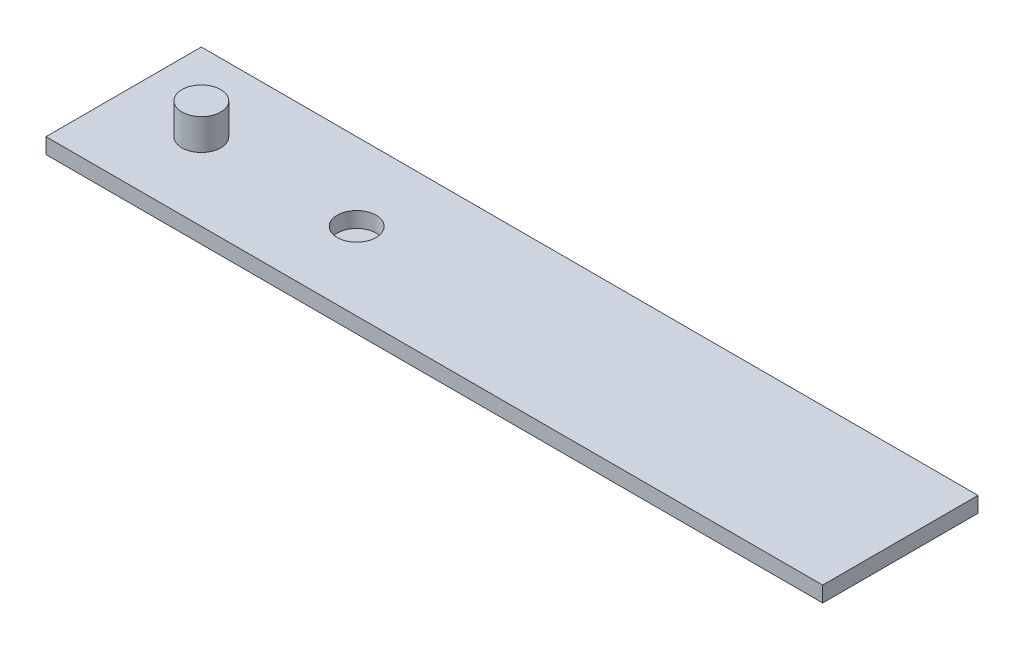
ISO-10303-21;
HEADER;
FILE_DESCRIPTION(('STEP AP214'),'2;1');
FILE_NAME('part.step','',(''),(''),'','','');
FILE_SCHEMA(('AUTOMOTIVE_DESIGN { 1 0 10303 214 1 1 1 1 }'));
ENDSEC;
DATA;
#1=APPLICATION_CONTEXT('core data for automotive mechanical design processes');
#2=APPLICATION_PROTOCOL_DEFINITION('international standard','automotive_design',2000,#1);
#3=PRODUCT_CONTEXT('',#1,'mechanical');
#4=PRODUCT('Part','Part','',(#3));
#5=PRODUCT_RELATED_PRODUCT_CATEGORY('part','',(#4));
#6=PRODUCT_DEFINITION_FORMATION('','',#4);
#7=PRODUCT_DEFINITION_CONTEXT('part definition',#1,'design');
#8=PRODUCT_DEFINITION('design','',#6,#7);
#9=PRODUCT_DEFINITION_SHAPE('','',#8);
#10=(LENGTH_UNIT() NAMED_UNIT(*) SI_UNIT(.MILLI.,.METRE.));
#11=(NAMED_UNIT(*) PLANE_ANGLE_UNIT() SI_UNIT($,.RADIAN.));
#12=(NAMED_UNIT(*) SI_UNIT($,.STERADIAN.) SOLID_ANGLE_UNIT());
#13=UNCERTAINTY_MEASURE_WITH_UNIT(LENGTH_MEASURE(1.E-05),#10,'distance_accuracy_value','');
#14=(GEOMETRIC_REPRESENTATION_CONTEXT(3) GLOBAL_UNCERTAINTY_ASSIGNED_CONTEXT((#13)) GLOBAL_UNIT_ASSIGNED_CONTEXT((#10,
#11,#12)) REPRESENTATION_CONTEXT('',''));
#15=CARTESIAN_POINT('',(0.,0.,0.));
#16=DIRECTION('',(0.,0.,1.));
#17=DIRECTION('',(1.,0.,0.));
#18=AXIS2_PLACEMENT_3D('',#15,#16,#17);
#19=CARTESIAN_POINT('',(38.1,-2.54,-12.7));
#20=DIRECTION('',(0.,1.,0.));
#21=DIRECTION('',(0.,0.,1.));
#22=AXIS2_PLACEMENT_3D('',#19,#20,#21);
#23=CYLINDRICAL_SURFACE('',#22,3.175);
#24=CARTESIAN_POINT('',(38.1,-2.54,-12.7));
#25=DIRECTION('',(0.,1.,0.));
#26=DIRECTION('',(0.,0.,1.));
#27=AXIS2_PLACEMENT_3D('',#24,#25,#26);
#28=CIRCLE('',#27,3.175);
#29=CARTESIAN_POINT('',(38.1,-2.54,-9.525));
#30=VERTEX_POINT('',#29);
#31=EDGE_CURVE('E11',#30,#30,#28,.T.);
#32=ORIENTED_EDGE('',*,*,#31,.T.);
#33=EDGE_LOOP('',(#32));
#34=FACE_BOUND('',#33,.T.);
#35=CARTESIAN_POINT('',(38.1,0.,-12.7));
#36=DIRECTION('',(0.,1.,0.));
#37=DIRECTION('',(0.,0.,1.));
#38=AXIS2_PLACEMENT_3D('',#35,#36,#37);
#39=CIRCLE('',#38,3.175);
#40=CARTESIAN_POINT('',(38.1,0.,-9.525));
#41=VERTEX_POINT('',#40);
#42=EDGE_CURVE('E50',#41,#41,#39,.T.);
#43=ORIENTED_EDGE('',*,*,#42,.F.);
#44=EDGE_LOOP('',(#43));
#45=FACE_BOUND('',#44,.T.);
#46=ADVANCED_FACE('F47',(#34,#45),#23,.T.);
#47=CARTESIAN_POINT('',(0.,-2.54,0.));
#48=DIRECTION('',(0.,1.,0.));
#49=DIRECTION('',(0.,0.,1.));
#50=AXIS2_PLACEMENT_3D('',#47,#48,#49);
#51=PLANE('',#50);
#52=ORIENTED_EDGE('',*,*,#31,.F.);
#53=EDGE_LOOP('',(#52));
#54=FACE_BOUND('',#53,.T.);
#55=ADVANCED_FACE('F62',(#54),#51,.F.);
#56=CARTESIAN_POINT('',(0.,0.,0.));
#57=DIRECTION('',(0.,1.,0.));
#58=DIRECTION('',(0.,0.,1.));
#59=AXIS2_PLACEMENT_3D('',#56,#57,#58);
#60=PLANE('',#59);
#61=ORIENTED_EDGE('',*,*,#42,.T.);
#62=EDGE_LOOP('',(#61));
#63=FACE_BOUND('',#62,.T.);
#64=ADVANCED_FACE('F59',(#63),#60,.T.);
#65=CLOSED_SHELL('',(#46,#55,#64));
#66=MANIFOLD_SOLID_BREP('B2',#65);
#67=CARTESIAN_POINT('',(0.,2.54,0.));
#68=DIRECTION('',(0.,-1.,0.));
#69=DIRECTION('',(0.,0.,-1.));
#70=AXIS2_PLACEMENT_3D('',#67,#68,#69);
#71=PLANE('',#70);
#72=DIRECTION('',(0.,0.,1.));
#73=VECTOR('',#72,1.);
#74=CARTESIAN_POINT('',(0.,2.54,0.));
#75=LINE('',#74,#73);
#76=CARTESIAN_POINT('',(0.,2.54,-25.4));
#77=VERTEX_POINT('',#76);
#78=CARTESIAN_POINT('',(0.,2.54,0.));
#79=VERTEX_POINT('',#78);
#80=EDGE_CURVE('E147',#77,#79,#75,.T.);
#81=ORIENTED_EDGE('',*,*,#80,.T.);
#82=DIRECTION('',(1.,0.,0.));
#83=VECTOR('',#82,1.);
#84=CARTESIAN_POINT('',(0.,2.54,0.));
#85=LINE('',#84,#83);
#86=CARTESIAN_POINT('',(127.,2.54,0.));
#87=VERTEX_POINT('',#86);
#88=EDGE_CURVE('E142',#79,#87,#85,.T.);
#89=ORIENTED_EDGE('',*,*,#88,.T.);
#90=DIRECTION('',(0.,0.,-1.));
#91=VECTOR('',#90,1.);
#92=CARTESIAN_POINT('',(127.,2.54,0.));
#93=LINE('',#92,#91);
#94=CARTESIAN_POINT('',(127.,2.54,-25.4));
#95=VERTEX_POINT('',#94);
#96=EDGE_CURVE('E145',#87,#95,#93,.T.);
#97=ORIENTED_EDGE('',*,*,#96,.T.);
#98=DIRECTION('',(-1.,0.,0.));
#99=VECTOR('',#98,1.);
#100=CARTESIAN_POINT('',(0.,2.54,-25.4));
#101=LINE('',#100,#99);
#102=EDGE_CURVE('E112',#95,#77,#101,.T.);
#103=ORIENTED_EDGE('',*,*,#102,.T.);
#104=EDGE_LOOP('',(#81,#89,#97,#103));
#105=FACE_BOUND('',#104,.T.);
#106=CARTESIAN_POINT('',(12.7,2.54,-12.7));
#107=DIRECTION('',(0.,1.,0.));
#108=DIRECTION('',(0.,0.,1.));
#109=AXIS2_PLACEMENT_3D('',#106,#107,#108);
#110=CIRCLE('',#109,3.175);
#111=CARTESIAN_POINT('',(12.7,2.54,-9.525));
#112=VERTEX_POINT('',#111);
#113=EDGE_CURVE('E167',#112,#112,#110,.T.);
#114=ORIENTED_EDGE('',*,*,#113,.F.);
#115=EDGE_LOOP('',(#114));
#116=FACE_BOUND('',#115,.T.);
#117=CARTESIAN_POINT('',(38.1,2.54,-12.7));
#118=DIRECTION('',(0.,1.,0.));
#119=DIRECTION('',(0.,0.,1.));
#120=AXIS2_PLACEMENT_3D('',#117,#118,#119);
#121=CIRCLE('',#120,3.175);
#122=CARTESIAN_POINT('',(38.1,2.54,-9.525));
#123=VERTEX_POINT('',#122);
#124=EDGE_CURVE('E188',#123,#123,#121,.T.);
#125=ORIENTED_EDGE('',*,*,#124,.F.);
#126=EDGE_LOOP('',(#125));
#127=FACE_BOUND('',#126,.T.);
#128=ADVANCED_FACE('F94',(#105,#116,#127),#71,.F.);
#129=CARTESIAN_POINT('',(0.,0.,0.));
#130=DIRECTION('',(0.,-1.,0.));
#131=DIRECTION('',(0.,0.,-1.));
#132=AXIS2_PLACEMENT_3D('',#129,#130,#131);
#133=PLANE('',#132);
#134=DIRECTION('',(0.,0.,1.));
#135=VECTOR('',#134,1.);
#136=CARTESIAN_POINT('',(0.,0.,0.));
#137=LINE('',#136,#135);
#138=CARTESIAN_POINT('',(0.,0.,-25.4));
#139=VERTEX_POINT('',#138);
#140=CARTESIAN_POINT('',(0.,0.,0.));
#141=VERTEX_POINT('',#140);
#142=EDGE_CURVE('E163',#139,#141,#137,.T.);
#143=ORIENTED_EDGE('',*,*,#142,.F.);
#144=DIRECTION('',(-1.,0.,0.));
#145=VECTOR('',#144,1.);
#146=CARTESIAN_POINT('',(0.,0.,-25.4));
#147=LINE('',#146,#145);
#148=CARTESIAN_POINT('',(127.,0.,-25.4));
#149=VERTEX_POINT('',#148);
#150=EDGE_CURVE('E135',#149,#139,#147,.T.);
#151=ORIENTED_EDGE('',*,*,#150,.F.);
#152=DIRECTION('',(0.,0.,-1.));
#153=VECTOR('',#152,1.);
#154=CARTESIAN_POINT('',(127.,0.,0.));
#155=LINE('',#154,#153);
#156=CARTESIAN_POINT('',(127.,0.,0.));
#157=VERTEX_POINT('',#156);
#158=EDGE_CURVE('E129',#157,#149,#155,.T.);
#159=ORIENTED_EDGE('',*,*,#158,.F.);
#160=DIRECTION('',(1.,0.,0.));
#161=VECTOR('',#160,1.);
#162=CARTESIAN_POINT('',(0.,0.,0.));
#163=LINE('',#162,#161);
#164=EDGE_CURVE('E152',#141,#157,#163,.T.);
#165=ORIENTED_EDGE('',*,*,#164,.F.);
#166=EDGE_LOOP('',(#143,#151,#159,#165));
#167=FACE_BOUND('',#166,.T.);
#168=CARTESIAN_POINT('',(38.1,0.,-12.7));
#169=DIRECTION('',(0.,1.,0.));
#170=DIRECTION('',(0.,0.,1.));
#171=AXIS2_PLACEMENT_3D('',#168,#169,#170);
#172=CIRCLE('',#171,3.175);
#173=CARTESIAN_POINT('',(38.1,0.,-9.525));
#174=VERTEX_POINT('',#173);
#175=EDGE_CURVE('E189',#174,#174,#172,.T.);
#176=ORIENTED_EDGE('',*,*,#175,.T.);
#177=EDGE_LOOP('',(#176));
#178=FACE_BOUND('',#177,.T.);
#179=ADVANCED_FACE('F180',(#167,#178),#133,.T.);
#180=CARTESIAN_POINT('',(0.,2.54,0.));
#181=DIRECTION('',(1.,0.,0.));
#182=DIRECTION('',(0.,0.,-1.));
#183=AXIS2_PLACEMENT_3D('',#180,#181,#182);
#184=PLANE('',#183);
#185=ORIENTED_EDGE('',*,*,#142,.T.);
#186=DIRECTION('',(0.,-1.,0.));
#187=VECTOR('',#186,1.);
#188=CARTESIAN_POINT('',(0.,2.54,0.));
#189=LINE('',#188,#187);
#190=EDGE_CURVE('E45',#79,#141,#189,.T.);
#191=ORIENTED_EDGE('',*,*,#190,.F.);
#192=ORIENTED_EDGE('',*,*,#80,.F.);
#193=DIRECTION('',(0.,-1.,0.));
#194=VECTOR('',#193,1.);
#195=CARTESIAN_POINT('',(0.,2.54,-25.4));
#196=LINE('',#195,#194);
#197=EDGE_CURVE('E159',#77,#139,#196,.T.);
#198=ORIENTED_EDGE('',*,*,#197,.T.);
#199=EDGE_LOOP('',(#185,#191,#192,#198));
#200=FACE_BOUND('',#199,.T.);
#201=ADVANCED_FACE('F96',(#200),#184,.F.);
#202=CARTESIAN_POINT('',(0.,2.54,0.));
#203=DIRECTION('',(0.,0.,-1.));
#204=DIRECTION('',(-1.,0.,0.));
#205=AXIS2_PLACEMENT_3D('',#202,#203,#204);
#206=PLANE('',#205);
#207=ORIENTED_EDGE('',*,*,#164,.T.);
#208=DIRECTION('',(0.,-1.,0.));
#209=VECTOR('',#208,1.);
#210=CARTESIAN_POINT('',(127.,2.54,0.));
#211=LINE('',#210,#209);
#212=EDGE_CURVE('E104',#87,#157,#211,.T.);
#213=ORIENTED_EDGE('',*,*,#212,.F.);
#214=ORIENTED_EDGE('',*,*,#88,.F.);
#215=ORIENTED_EDGE('',*,*,#190,.T.);
#216=EDGE_LOOP('',(#207,#213,#214,#215));
#217=FACE_BOUND('',#216,.T.);
#218=ADVANCED_FACE('F151',(#217),#206,.F.);
#219=CARTESIAN_POINT('',(127.,2.54,0.));
#220=DIRECTION('',(-1.,0.,0.));
#221=DIRECTION('',(0.,0.,1.));
#222=AXIS2_PLACEMENT_3D('',#219,#220,#221);
#223=PLANE('',#222);
#224=ORIENTED_EDGE('',*,*,#158,.T.);
#225=DIRECTION('',(0.,-1.,0.));
#226=VECTOR('',#225,1.);
#227=CARTESIAN_POINT('',(127.,2.54,-25.4));
#228=LINE('',#227,#226);
#229=EDGE_CURVE('E154',#95,#149,#228,.T.);
#230=ORIENTED_EDGE('',*,*,#229,.F.);
#231=ORIENTED_EDGE('',*,*,#96,.F.);
#232=ORIENTED_EDGE('',*,*,#212,.T.);
#233=EDGE_LOOP('',(#224,#230,#231,#232));
#234=FACE_BOUND('',#233,.T.);
#235=ADVANCED_FACE('F155',(#234),#223,.F.);
#236=CARTESIAN_POINT('',(0.,2.54,-25.4));
#237=DIRECTION('',(0.,0.,1.));
#238=DIRECTION('',(1.,0.,0.));
#239=AXIS2_PLACEMENT_3D('',#236,#237,#238);
#240=PLANE('',#239);
#241=ORIENTED_EDGE('',*,*,#150,.T.);
#242=ORIENTED_EDGE('',*,*,#197,.F.);
#243=ORIENTED_EDGE('',*,*,#102,.F.);
#244=ORIENTED_EDGE('',*,*,#229,.T.);
#245=EDGE_LOOP('',(#241,#242,#243,#244));
#246=FACE_BOUND('',#245,.T.);
#247=ADVANCED_FACE('F177',(#246),#240,.F.);
#248=CARTESIAN_POINT('',(38.1,2.54,-12.7));
#249=DIRECTION('',(0.,-1.,0.));
#250=DIRECTION('',(0.,0.,-1.));
#251=AXIS2_PLACEMENT_3D('',#248,#249,#250);
#252=CYLINDRICAL_SURFACE('',#251,3.175);
#253=ORIENTED_EDGE('',*,*,#124,.T.);
#254=EDGE_LOOP('',(#253));
#255=FACE_BOUND('',#254,.T.);
#256=ORIENTED_EDGE('',*,*,#175,.F.);
#257=EDGE_LOOP('',(#256));
#258=FACE_BOUND('',#257,.T.);
#259=ADVANCED_FACE('F206',(#255,#258),#252,.F.);
#260=CARTESIAN_POINT('',(12.7,7.62,-12.7));
#261=DIRECTION('',(0.,-1.,0.));
#262=DIRECTION('',(0.,0.,-1.));
#263=AXIS2_PLACEMENT_3D('',#260,#261,#262);
#264=CYLINDRICAL_SURFACE('',#263,3.175);
#265=CARTESIAN_POINT('',(12.7,7.62,-12.7));
#266=DIRECTION('',(0.,1.,0.));
#267=DIRECTION('',(0.,0.,1.));
#268=AXIS2_PLACEMENT_3D('',#265,#266,#267);
#269=CIRCLE('',#268,3.175);
#270=CARTESIAN_POINT('',(12.7,7.62,-9.525));
#271=VERTEX_POINT('',#270);
#272=EDGE_CURVE('E193',#271,#271,#269,.T.);
#273=ORIENTED_EDGE('',*,*,#272,.F.);
#274=EDGE_LOOP('',(#273));
#275=FACE_BOUND('',#274,.T.);
#276=ORIENTED_EDGE('',*,*,#113,.T.);
#277=EDGE_LOOP('',(#276));
#278=FACE_BOUND('',#277,.T.);
#279=ADVANCED_FACE('F203',(#275,#278),#264,.T.);
#280=CARTESIAN_POINT('',(0.,7.62,0.));
#281=DIRECTION('',(0.,1.,0.));
#282=DIRECTION('',(0.,0.,1.));
#283=AXIS2_PLACEMENT_3D('',#280,#281,#282);
#284=PLANE('',#283);
#285=ORIENTED_EDGE('',*,*,#272,.T.);
#286=EDGE_LOOP('',(#285));
#287=FACE_BOUND('',#286,.T.);
#288=ADVANCED_FACE('F201',(#287),#284,.T.);
#289=CLOSED_SHELL('',(#128,#179,#201,#218,#235,#247,#259,#279,#288));
#290=MANIFOLD_SOLID_BREP('B6',#289);
#291=ADVANCED_BREP_SHAPE_REPRESENTATION('',(#18,#66,#290),#14);
#292=SHAPE_DEFINITION_REPRESENTATION(#9,#291);
ENDSEC;
END-ISO-10303-21;
